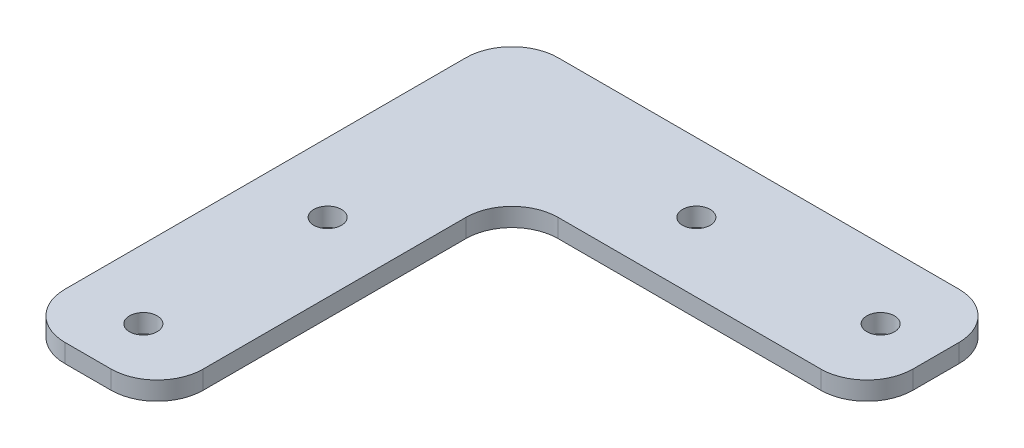
ISO-10303-21;
HEADER;
FILE_DESCRIPTION(('STEP AP214'),'2;1');
FILE_NAME('part.step','',(''),(''),'','','');
FILE_SCHEMA(('AUTOMOTIVE_DESIGN { 1 0 10303 214 1 1 1 1 }'));
ENDSEC;
DATA;
#1=APPLICATION_CONTEXT('core data for automotive mechanical design processes');
#2=APPLICATION_PROTOCOL_DEFINITION('international standard','automotive_design',2000,#1);
#3=PRODUCT_CONTEXT('',#1,'mechanical');
#4=PRODUCT('Part','Part','',(#3));
#5=PRODUCT_RELATED_PRODUCT_CATEGORY('part','',(#4));
#6=PRODUCT_DEFINITION_FORMATION('','',#4);
#7=PRODUCT_DEFINITION_CONTEXT('part definition',#1,'design');
#8=PRODUCT_DEFINITION('design','',#6,#7);
#9=PRODUCT_DEFINITION_SHAPE('','',#8);
#10=(LENGTH_UNIT() NAMED_UNIT(*) SI_UNIT(.MILLI.,.METRE.));
#11=(NAMED_UNIT(*) PLANE_ANGLE_UNIT() SI_UNIT($,.RADIAN.));
#12=(NAMED_UNIT(*) SI_UNIT($,.STERADIAN.) SOLID_ANGLE_UNIT());
#13=UNCERTAINTY_MEASURE_WITH_UNIT(LENGTH_MEASURE(1.E-05),#10,'distance_accuracy_value','');
#14=(GEOMETRIC_REPRESENTATION_CONTEXT(3) GLOBAL_UNCERTAINTY_ASSIGNED_CONTEXT((#13)) GLOBAL_UNIT_ASSIGNED_CONTEXT((#10,
#11,#12)) REPRESENTATION_CONTEXT('',''));
#15=CARTESIAN_POINT('',(0.,0.,0.));
#16=DIRECTION('',(0.,0.,1.));
#17=DIRECTION('',(1.,0.,0.));
#18=AXIS2_PLACEMENT_3D('',#15,#16,#17);
#19=CARTESIAN_POINT('',(0.,2.,0.));
#20=DIRECTION('',(0.,1.,0.));
#21=DIRECTION('',(0.,0.,1.));
#22=AXIS2_PLACEMENT_3D('',#19,#20,#21);
#23=PLANE('',#22);
#24=CARTESIAN_POINT('',(20.,2.,2.15105711021124E-13));
#25=DIRECTION('',(0.,1.,0.));
#26=DIRECTION('',(0.,0.,-1.));
#27=AXIS2_PLACEMENT_3D('',#24,#25,#26);
#28=CIRCLE('',#27,1.5);
#29=CARTESIAN_POINT('',(20.,2.,-1.49999999999979));
#30=VERTEX_POINT('',#29);
#31=EDGE_CURVE('E287',#30,#30,#28,.T.);
#32=ORIENTED_EDGE('',*,*,#31,.F.);
#33=EDGE_LOOP('',(#32));
#34=FACE_BOUND('',#33,.T.);
#35=CARTESIAN_POINT('',(0.,2.,40.));
#36=DIRECTION('',(0.,1.,0.));
#37=DIRECTION('',(0.,0.,1.));
#38=AXIS2_PLACEMENT_3D('',#35,#36,#37);
#39=CIRCLE('',#38,1.5);
#40=CARTESIAN_POINT('',(0.,2.,41.5));
#41=VERTEX_POINT('',#40);
#42=EDGE_CURVE('E273',#41,#41,#39,.T.);
#43=ORIENTED_EDGE('',*,*,#42,.F.);
#44=EDGE_LOOP('',(#43));
#45=FACE_BOUND('',#44,.T.);
#46=DIRECTION('',(1.,0.,0.));
#47=VECTOR('',#46,1.);
#48=CARTESIAN_POINT('',(7.5,2.,46.));
#49=LINE('',#48,#47);
#50=CARTESIAN_POINT('',(-2.5,2.,46.));
#51=VERTEX_POINT('',#50);
#52=CARTESIAN_POINT('',(2.5,2.,46.));
#53=VERTEX_POINT('',#52);
#54=EDGE_CURVE('E250',#51,#53,#49,.T.);
#55=ORIENTED_EDGE('',*,*,#54,.T.);
#56=CARTESIAN_POINT('',(2.5,2.,41.));
#57=DIRECTION('',(0.,1.,0.));
#58=DIRECTION('',(0.,0.,1.));
#59=AXIS2_PLACEMENT_3D('',#56,#57,#58);
#60=CIRCLE('',#59,5.);
#61=CARTESIAN_POINT('',(7.5,2.,41.));
#62=VERTEX_POINT('',#61);
#63=EDGE_CURVE('E209',#53,#62,#60,.T.);
#64=ORIENTED_EDGE('',*,*,#63,.T.);
#65=DIRECTION('',(0.,0.,-1.));
#66=VECTOR('',#65,1.);
#67=CARTESIAN_POINT('',(7.5,2.,7.50000000000007));
#68=LINE('',#67,#66);
#69=CARTESIAN_POINT('',(7.5,2.,12.5000000000001));
#70=VERTEX_POINT('',#69);
#71=EDGE_CURVE('E159',#62,#70,#68,.T.);
#72=ORIENTED_EDGE('',*,*,#71,.T.);
#73=CARTESIAN_POINT('',(12.5,2.,12.5000000000001));
#74=DIRECTION('',(0.,1.,0.));
#75=DIRECTION('',(0.,0.,1.));
#76=AXIS2_PLACEMENT_3D('',#73,#74,#75);
#77=CIRCLE('',#76,5.);
#78=CARTESIAN_POINT('',(12.5000000000001,2.,7.50000000000013));
#79=VERTEX_POINT('',#78);
#80=EDGE_CURVE('E11',#70,#79,#77,.F.);
#81=ORIENTED_EDGE('',*,*,#80,.T.);
#82=DIRECTION('',(1.,0.,0.));
#83=VECTOR('',#82,1.);
#84=CARTESIAN_POINT('',(7.5,2.,7.50000000000007));
#85=LINE('',#84,#83);
#86=CARTESIAN_POINT('',(40.9999999999999,2.,7.50000000000044));
#87=VERTEX_POINT('',#86);
#88=EDGE_CURVE('E168',#79,#87,#85,.T.);
#89=ORIENTED_EDGE('',*,*,#88,.T.);
#90=CARTESIAN_POINT('',(41.,2.,2.50000000000044));
#91=DIRECTION('',(0.,1.,0.));
#92=DIRECTION('',(0.,0.,1.));
#93=AXIS2_PLACEMENT_3D('',#90,#91,#92);
#94=CIRCLE('',#93,5.);
#95=CARTESIAN_POINT('',(46.,2.,2.5000000000005));
#96=VERTEX_POINT('',#95);
#97=EDGE_CURVE('E198',#87,#96,#94,.T.);
#98=ORIENTED_EDGE('',*,*,#97,.T.);
#99=DIRECTION('',(0.,0.,-1.));
#100=VECTOR('',#99,1.);
#101=CARTESIAN_POINT('',(45.9999999999999,2.,7.5000000000005));
#102=LINE('',#101,#100);
#103=CARTESIAN_POINT('',(46.,2.,-2.4999999999995));
#104=VERTEX_POINT('',#103);
#105=EDGE_CURVE('E175',#96,#104,#102,.T.);
#106=ORIENTED_EDGE('',*,*,#105,.T.);
#107=CARTESIAN_POINT('',(41.,2.,-2.49999999999955));
#108=DIRECTION('',(0.,1.,0.));
#109=DIRECTION('',(0.,0.,1.));
#110=AXIS2_PLACEMENT_3D('',#107,#108,#109);
#111=CIRCLE('',#110,5.);
#112=CARTESIAN_POINT('',(41.0000000000001,2.,-7.49999999999955));
#113=VERTEX_POINT('',#112);
#114=EDGE_CURVE('E201',#104,#113,#111,.T.);
#115=ORIENTED_EDGE('',*,*,#114,.T.);
#116=DIRECTION('',(-1.,0.,0.));
#117=VECTOR('',#116,1.);
#118=CARTESIAN_POINT('',(46.0000000000001,2.,-7.4999999999995));
#119=LINE('',#118,#117);
#120=CARTESIAN_POINT('',(-2.49999999999995,2.,-7.50000000000002));
#121=VERTEX_POINT('',#120);
#122=EDGE_CURVE('E260',#113,#121,#119,.T.);
#123=ORIENTED_EDGE('',*,*,#122,.T.);
#124=CARTESIAN_POINT('',(-2.5,2.,-2.50000000000002));
#125=DIRECTION('',(0.,1.,0.));
#126=DIRECTION('',(0.,0.,1.));
#127=AXIS2_PLACEMENT_3D('',#124,#125,#126);
#128=CIRCLE('',#127,5.);
#129=CARTESIAN_POINT('',(-7.5,2.,-2.50000000000002));
#130=VERTEX_POINT('',#129);
#131=EDGE_CURVE('E70',#121,#130,#128,.T.);
#132=ORIENTED_EDGE('',*,*,#131,.T.);
#133=DIRECTION('',(0.,0.,1.));
#134=VECTOR('',#133,1.);
#135=CARTESIAN_POINT('',(-7.5,2.,46.));
#136=LINE('',#135,#134);
#137=CARTESIAN_POINT('',(-7.5,2.,41.));
#138=VERTEX_POINT('',#137);
#139=EDGE_CURVE('E256',#130,#138,#136,.T.);
#140=ORIENTED_EDGE('',*,*,#139,.T.);
#141=CARTESIAN_POINT('',(-2.5,2.,41.));
#142=DIRECTION('',(0.,1.,0.));
#143=DIRECTION('',(0.,0.,1.));
#144=AXIS2_PLACEMENT_3D('',#141,#142,#143);
#145=CIRCLE('',#144,5.);
#146=EDGE_CURVE('E206',#138,#51,#145,.T.);
#147=ORIENTED_EDGE('',*,*,#146,.T.);
#148=EDGE_LOOP('',(#55,#64,#72,#81,#89,#98,#106,#115,#123,#132,#140,#147));
#149=FACE_BOUND('',#148,.T.);
#150=CARTESIAN_POINT('',(0.,2.,20.));
#151=DIRECTION('',(0.,1.,0.));
#152=DIRECTION('',(0.,0.,1.));
#153=AXIS2_PLACEMENT_3D('',#150,#151,#152);
#154=CIRCLE('',#153,1.5);
#155=CARTESIAN_POINT('',(0.,2.,21.5));
#156=VERTEX_POINT('',#155);
#157=EDGE_CURVE('E313',#156,#156,#154,.T.);
#158=ORIENTED_EDGE('',*,*,#157,.F.);
#159=EDGE_LOOP('',(#158));
#160=FACE_BOUND('',#159,.T.);
#161=CARTESIAN_POINT('',(40.,2.,4.37150315946155E-13));
#162=DIRECTION('',(0.,1.,0.));
#163=DIRECTION('',(0.,0.,-1.));
#164=AXIS2_PLACEMENT_3D('',#161,#162,#163);
#165=CIRCLE('',#164,1.5);
#166=CARTESIAN_POINT('',(40.,2.,-1.49999999999957));
#167=VERTEX_POINT('',#166);
#168=EDGE_CURVE('E288',#167,#167,#165,.T.);
#169=ORIENTED_EDGE('',*,*,#168,.F.);
#170=EDGE_LOOP('',(#169));
#171=FACE_BOUND('',#170,.T.);
#172=ADVANCED_FACE('F47',(#34,#45,#149,#160,#171),#23,.T.);
#173=CARTESIAN_POINT('',(0.,0.,0.));
#174=DIRECTION('',(0.,1.,0.));
#175=DIRECTION('',(0.,0.,1.));
#176=AXIS2_PLACEMENT_3D('',#173,#174,#175);
#177=PLANE('',#176);
#178=DIRECTION('',(0.,0.,-1.));
#179=VECTOR('',#178,1.);
#180=CARTESIAN_POINT('',(7.5,0.,7.50000000000007));
#181=LINE('',#180,#179);
#182=CARTESIAN_POINT('',(7.5,0.,41.));
#183=VERTEX_POINT('',#182);
#184=CARTESIAN_POINT('',(7.5,0.,12.5000000000001));
#185=VERTEX_POINT('',#184);
#186=EDGE_CURVE('E156',#183,#185,#181,.T.);
#187=ORIENTED_EDGE('',*,*,#186,.F.);
#188=CARTESIAN_POINT('',(2.5,0.,41.));
#189=DIRECTION('',(0.,1.,0.));
#190=DIRECTION('',(0.,0.,1.));
#191=AXIS2_PLACEMENT_3D('',#188,#189,#190);
#192=CIRCLE('',#191,5.);
#193=CARTESIAN_POINT('',(2.5,0.,46.));
#194=VERTEX_POINT('',#193);
#195=EDGE_CURVE('E138',#183,#194,#192,.F.);
#196=ORIENTED_EDGE('',*,*,#195,.T.);
#197=DIRECTION('',(1.,0.,0.));
#198=VECTOR('',#197,1.);
#199=CARTESIAN_POINT('',(7.5,0.,46.));
#200=LINE('',#199,#198);
#201=CARTESIAN_POINT('',(-2.5,0.,46.));
#202=VERTEX_POINT('',#201);
#203=EDGE_CURVE('E169',#202,#194,#200,.T.);
#204=ORIENTED_EDGE('',*,*,#203,.F.);
#205=CARTESIAN_POINT('',(-2.5,0.,41.));
#206=DIRECTION('',(0.,1.,0.));
#207=DIRECTION('',(0.,0.,1.));
#208=AXIS2_PLACEMENT_3D('',#205,#206,#207);
#209=CIRCLE('',#208,5.);
#210=CARTESIAN_POINT('',(-7.5,0.,41.));
#211=VERTEX_POINT('',#210);
#212=EDGE_CURVE('E150',#202,#211,#209,.F.);
#213=ORIENTED_EDGE('',*,*,#212,.T.);
#214=DIRECTION('',(0.,0.,1.));
#215=VECTOR('',#214,1.);
#216=CARTESIAN_POINT('',(-7.5,0.,46.));
#217=LINE('',#216,#215);
#218=CARTESIAN_POINT('',(-7.5,0.,-2.50000000000002));
#219=VERTEX_POINT('',#218);
#220=EDGE_CURVE('E177',#219,#211,#217,.T.);
#221=ORIENTED_EDGE('',*,*,#220,.F.);
#222=CARTESIAN_POINT('',(-2.5,0.,-2.50000000000002));
#223=DIRECTION('',(0.,1.,0.));
#224=DIRECTION('',(0.,0.,1.));
#225=AXIS2_PLACEMENT_3D('',#222,#223,#224);
#226=CIRCLE('',#225,5.);
#227=CARTESIAN_POINT('',(-2.49999999999995,0.,-7.50000000000002));
#228=VERTEX_POINT('',#227);
#229=EDGE_CURVE('E188',#219,#228,#226,.F.);
#230=ORIENTED_EDGE('',*,*,#229,.T.);
#231=DIRECTION('',(-1.,0.,0.));
#232=VECTOR('',#231,1.);
#233=CARTESIAN_POINT('',(46.0000000000001,0.,-7.4999999999995));
#234=LINE('',#233,#232);
#235=CARTESIAN_POINT('',(41.0000000000001,0.,-7.49999999999955));
#236=VERTEX_POINT('',#235);
#237=EDGE_CURVE('E452',#236,#228,#234,.T.);
#238=ORIENTED_EDGE('',*,*,#237,.F.);
#239=CARTESIAN_POINT('',(41.,0.,-2.49999999999955));
#240=DIRECTION('',(0.,1.,0.));
#241=DIRECTION('',(0.,0.,1.));
#242=AXIS2_PLACEMENT_3D('',#239,#240,#241);
#243=CIRCLE('',#242,5.);
#244=CARTESIAN_POINT('',(46.,0.,-2.4999999999995));
#245=VERTEX_POINT('',#244);
#246=EDGE_CURVE('E185',#236,#245,#243,.F.);
#247=ORIENTED_EDGE('',*,*,#246,.T.);
#248=DIRECTION('',(0.,0.,-1.));
#249=VECTOR('',#248,1.);
#250=CARTESIAN_POINT('',(45.9999999999999,0.,7.5000000000005));
#251=LINE('',#250,#249);
#252=CARTESIAN_POINT('',(46.,0.,2.5000000000005));
#253=VERTEX_POINT('',#252);
#254=EDGE_CURVE('E456',#253,#245,#251,.T.);
#255=ORIENTED_EDGE('',*,*,#254,.F.);
#256=CARTESIAN_POINT('',(41.,0.,2.50000000000044));
#257=DIRECTION('',(0.,1.,0.));
#258=DIRECTION('',(0.,0.,1.));
#259=AXIS2_PLACEMENT_3D('',#256,#257,#258);
#260=CIRCLE('',#259,5.);
#261=CARTESIAN_POINT('',(40.9999999999999,0.,7.50000000000044));
#262=VERTEX_POINT('',#261);
#263=EDGE_CURVE('E161',#253,#262,#260,.F.);
#264=ORIENTED_EDGE('',*,*,#263,.T.);
#265=DIRECTION('',(1.,0.,0.));
#266=VECTOR('',#265,1.);
#267=CARTESIAN_POINT('',(7.5,0.,7.50000000000007));
#268=LINE('',#267,#266);
#269=CARTESIAN_POINT('',(12.5000000000001,0.,7.50000000000013));
#270=VERTEX_POINT('',#269);
#271=EDGE_CURVE('E278',#270,#262,#268,.T.);
#272=ORIENTED_EDGE('',*,*,#271,.F.);
#273=CARTESIAN_POINT('',(12.5,0.,12.5000000000001));
#274=DIRECTION('',(0.,1.,0.));
#275=DIRECTION('',(0.,0.,1.));
#276=AXIS2_PLACEMENT_3D('',#273,#274,#275);
#277=CIRCLE('',#276,5.);
#278=EDGE_CURVE('E56',#270,#185,#277,.T.);
#279=ORIENTED_EDGE('',*,*,#278,.T.);
#280=EDGE_LOOP('',(#187,#196,#204,#213,#221,#230,#238,#247,#255,#264,#272,#279));
#281=FACE_BOUND('',#280,.T.);
#282=CARTESIAN_POINT('',(0.,0.,40.));
#283=DIRECTION('',(0.,1.,0.));
#284=DIRECTION('',(0.,0.,1.));
#285=AXIS2_PLACEMENT_3D('',#282,#283,#284);
#286=CIRCLE('',#285,1.5);
#287=CARTESIAN_POINT('',(0.,0.,41.5));
#288=VERTEX_POINT('',#287);
#289=EDGE_CURVE('E279',#288,#288,#286,.T.);
#290=ORIENTED_EDGE('',*,*,#289,.T.);
#291=EDGE_LOOP('',(#290));
#292=FACE_BOUND('',#291,.T.);
#293=CARTESIAN_POINT('',(0.,0.,20.));
#294=DIRECTION('',(0.,1.,0.));
#295=DIRECTION('',(0.,0.,1.));
#296=AXIS2_PLACEMENT_3D('',#293,#294,#295);
#297=CIRCLE('',#296,1.5);
#298=CARTESIAN_POINT('',(0.,0.,21.5));
#299=VERTEX_POINT('',#298);
#300=EDGE_CURVE('E307',#299,#299,#297,.T.);
#301=ORIENTED_EDGE('',*,*,#300,.T.);
#302=EDGE_LOOP('',(#301));
#303=FACE_BOUND('',#302,.T.);
#304=CARTESIAN_POINT('',(20.,0.,2.15105711021124E-13));
#305=DIRECTION('',(0.,1.,0.));
#306=DIRECTION('',(0.,0.,-1.));
#307=AXIS2_PLACEMENT_3D('',#304,#305,#306);
#308=CIRCLE('',#307,1.5);
#309=CARTESIAN_POINT('',(20.,0.,-1.49999999999979));
#310=VERTEX_POINT('',#309);
#311=EDGE_CURVE('E283',#310,#310,#308,.T.);
#312=ORIENTED_EDGE('',*,*,#311,.T.);
#313=EDGE_LOOP('',(#312));
#314=FACE_BOUND('',#313,.T.);
#315=CARTESIAN_POINT('',(40.,0.,4.37150315946155E-13));
#316=DIRECTION('',(0.,1.,0.));
#317=DIRECTION('',(0.,0.,-1.));
#318=AXIS2_PLACEMENT_3D('',#315,#316,#317);
#319=CIRCLE('',#318,1.5);
#320=CARTESIAN_POINT('',(40.,0.,-1.49999999999957));
#321=VERTEX_POINT('',#320);
#322=EDGE_CURVE('E293',#321,#321,#319,.T.);
#323=ORIENTED_EDGE('',*,*,#322,.T.);
#324=EDGE_LOOP('',(#323));
#325=FACE_BOUND('',#324,.T.);
#326=ADVANCED_FACE('F164',(#281,#292,#303,#314,#325),#177,.F.);
#327=CARTESIAN_POINT('',(7.5,2.,7.50000000000007));
#328=DIRECTION('',(0.,0.,-1.));
#329=DIRECTION('',(-1.,0.,0.));
#330=AXIS2_PLACEMENT_3D('',#327,#328,#329);
#331=PLANE('',#330);
#332=ORIENTED_EDGE('',*,*,#271,.T.);
#333=DIRECTION('',(0.,-1.,0.));
#334=VECTOR('',#333,1.);
#335=CARTESIAN_POINT('',(40.9999999999999,2.,7.50000000000044));
#336=LINE('',#335,#334);
#337=EDGE_CURVE('E236',#262,#87,#336,.F.);
#338=ORIENTED_EDGE('',*,*,#337,.T.);
#339=ORIENTED_EDGE('',*,*,#88,.F.);
#340=DIRECTION('',(0.,-1.,0.));
#341=VECTOR('',#340,1.);
#342=CARTESIAN_POINT('',(12.5000000000001,0.,7.50000000000013));
#343=LINE('',#342,#341);
#344=EDGE_CURVE('E232',#79,#270,#343,.T.);
#345=ORIENTED_EDGE('',*,*,#344,.T.);
#346=EDGE_LOOP('',(#332,#338,#339,#345));
#347=FACE_BOUND('',#346,.T.);
#348=ADVANCED_FACE('F374',(#347),#331,.F.);
#349=CARTESIAN_POINT('',(45.9999999999999,2.,7.5000000000005));
#350=DIRECTION('',(-1.,0.,0.));
#351=DIRECTION('',(0.,0.,1.));
#352=AXIS2_PLACEMENT_3D('',#349,#350,#351);
#353=PLANE('',#352);
#354=ORIENTED_EDGE('',*,*,#254,.T.);
#355=DIRECTION('',(0.,-1.,0.));
#356=VECTOR('',#355,1.);
#357=CARTESIAN_POINT('',(46.,2.,-2.4999999999995));
#358=LINE('',#357,#356);
#359=EDGE_CURVE('E229',#245,#104,#358,.F.);
#360=ORIENTED_EDGE('',*,*,#359,.T.);
#361=ORIENTED_EDGE('',*,*,#105,.F.);
#362=DIRECTION('',(0.,-1.,0.));
#363=VECTOR('',#362,1.);
#364=CARTESIAN_POINT('',(46.,2.,2.5000000000005));
#365=LINE('',#364,#363);
#366=EDGE_CURVE('E225',#96,#253,#365,.T.);
#367=ORIENTED_EDGE('',*,*,#366,.T.);
#368=EDGE_LOOP('',(#354,#360,#361,#367));
#369=FACE_BOUND('',#368,.T.);
#370=ADVANCED_FACE('F378',(#369),#353,.F.);
#371=CARTESIAN_POINT('',(46.0000000000001,2.,-7.4999999999995));
#372=DIRECTION('',(0.,0.,1.));
#373=DIRECTION('',(1.,0.,0.));
#374=AXIS2_PLACEMENT_3D('',#371,#372,#373);
#375=PLANE('',#374);
#376=ORIENTED_EDGE('',*,*,#237,.T.);
#377=DIRECTION('',(0.,-1.,0.));
#378=VECTOR('',#377,1.);
#379=CARTESIAN_POINT('',(-2.49999999999995,2.,-7.50000000000002));
#380=LINE('',#379,#378);
#381=EDGE_CURVE('E222',#228,#121,#380,.F.);
#382=ORIENTED_EDGE('',*,*,#381,.T.);
#383=ORIENTED_EDGE('',*,*,#122,.F.);
#384=DIRECTION('',(0.,-1.,0.));
#385=VECTOR('',#384,1.);
#386=CARTESIAN_POINT('',(41.0000000000001,2.,-7.49999999999955));
#387=LINE('',#386,#385);
#388=EDGE_CURVE('E218',#113,#236,#387,.T.);
#389=ORIENTED_EDGE('',*,*,#388,.T.);
#390=EDGE_LOOP('',(#376,#382,#383,#389));
#391=FACE_BOUND('',#390,.T.);
#392=ADVANCED_FACE('F330',(#391),#375,.F.);
#393=CARTESIAN_POINT('',(-7.5,2.,46.));
#394=DIRECTION('',(1.,0.,0.));
#395=DIRECTION('',(0.,0.,-1.));
#396=AXIS2_PLACEMENT_3D('',#393,#394,#395);
#397=PLANE('',#396);
#398=ORIENTED_EDGE('',*,*,#220,.T.);
#399=DIRECTION('',(0.,-1.,0.));
#400=VECTOR('',#399,1.);
#401=CARTESIAN_POINT('',(-7.5,2.,41.));
#402=LINE('',#401,#400);
#403=EDGE_CURVE('E63',#211,#138,#402,.F.);
#404=ORIENTED_EDGE('',*,*,#403,.T.);
#405=ORIENTED_EDGE('',*,*,#139,.F.);
#406=DIRECTION('',(0.,-1.,0.));
#407=VECTOR('',#406,1.);
#408=CARTESIAN_POINT('',(-7.5,2.,-2.50000000000002));
#409=LINE('',#408,#407);
#410=EDGE_CURVE('E212',#130,#219,#409,.T.);
#411=ORIENTED_EDGE('',*,*,#410,.T.);
#412=EDGE_LOOP('',(#398,#404,#405,#411));
#413=FACE_BOUND('',#412,.T.);
#414=ADVANCED_FACE('F325',(#413),#397,.F.);
#415=CARTESIAN_POINT('',(7.5,2.,46.));
#416=DIRECTION('',(0.,0.,-1.));
#417=DIRECTION('',(-1.,0.,0.));
#418=AXIS2_PLACEMENT_3D('',#415,#416,#417);
#419=PLANE('',#418);
#420=ORIENTED_EDGE('',*,*,#203,.T.);
#421=DIRECTION('',(0.,-1.,0.));
#422=VECTOR('',#421,1.);
#423=CARTESIAN_POINT('',(2.5,2.,46.));
#424=LINE('',#423,#422);
#425=EDGE_CURVE('E143',#194,#53,#424,.F.);
#426=ORIENTED_EDGE('',*,*,#425,.T.);
#427=ORIENTED_EDGE('',*,*,#54,.F.);
#428=DIRECTION('',(0.,-1.,0.));
#429=VECTOR('',#428,1.);
#430=CARTESIAN_POINT('',(-2.5,2.,46.));
#431=LINE('',#430,#429);
#432=EDGE_CURVE('E149',#51,#202,#431,.T.);
#433=ORIENTED_EDGE('',*,*,#432,.T.);
#434=EDGE_LOOP('',(#420,#426,#427,#433));
#435=FACE_BOUND('',#434,.T.);
#436=ADVANCED_FACE('F329',(#435),#419,.F.);
#437=CARTESIAN_POINT('',(7.5,2.,7.50000000000007));
#438=DIRECTION('',(-1.,0.,0.));
#439=DIRECTION('',(0.,0.,1.));
#440=AXIS2_PLACEMENT_3D('',#437,#438,#439);
#441=PLANE('',#440);
#442=ORIENTED_EDGE('',*,*,#71,.F.);
#443=DIRECTION('',(0.,-1.,0.));
#444=VECTOR('',#443,1.);
#445=CARTESIAN_POINT('',(7.5,2.,41.));
#446=LINE('',#445,#444);
#447=EDGE_CURVE('E142',#62,#183,#446,.T.);
#448=ORIENTED_EDGE('',*,*,#447,.T.);
#449=ORIENTED_EDGE('',*,*,#186,.T.);
#450=DIRECTION('',(0.,-1.,0.));
#451=VECTOR('',#450,1.);
#452=CARTESIAN_POINT('',(7.5,2.,12.5000000000001));
#453=LINE('',#452,#451);
#454=EDGE_CURVE('E162',#185,#70,#453,.F.);
#455=ORIENTED_EDGE('',*,*,#454,.T.);
#456=EDGE_LOOP('',(#442,#448,#449,#455));
#457=FACE_BOUND('',#456,.T.);
#458=ADVANCED_FACE('F155',(#457),#441,.F.);
#459=CARTESIAN_POINT('',(0.,2.,40.));
#460=DIRECTION('',(0.,-1.,0.));
#461=DIRECTION('',(0.,0.,-1.));
#462=AXIS2_PLACEMENT_3D('',#459,#460,#461);
#463=CYLINDRICAL_SURFACE('',#462,1.5);
#464=ORIENTED_EDGE('',*,*,#42,.T.);
#465=EDGE_LOOP('',(#464));
#466=FACE_BOUND('',#465,.T.);
#467=ORIENTED_EDGE('',*,*,#289,.F.);
#468=EDGE_LOOP('',(#467));
#469=FACE_BOUND('',#468,.T.);
#470=ADVANCED_FACE('F362',(#466,#469),#463,.F.);
#471=CARTESIAN_POINT('',(0.,2.,20.));
#472=DIRECTION('',(0.,-1.,0.));
#473=DIRECTION('',(0.,0.,-1.));
#474=AXIS2_PLACEMENT_3D('',#471,#472,#473);
#475=CYLINDRICAL_SURFACE('',#474,1.5);
#476=ORIENTED_EDGE('',*,*,#157,.T.);
#477=EDGE_LOOP('',(#476));
#478=FACE_BOUND('',#477,.T.);
#479=ORIENTED_EDGE('',*,*,#300,.F.);
#480=EDGE_LOOP('',(#479));
#481=FACE_BOUND('',#480,.T.);
#482=ADVANCED_FACE('F423',(#478,#481),#475,.F.);
#483=CARTESIAN_POINT('',(20.,2.,2.15105711021124E-13));
#484=DIRECTION('',(0.,-1.,0.));
#485=DIRECTION('',(0.,0.,-1.));
#486=AXIS2_PLACEMENT_3D('',#483,#484,#485);
#487=CYLINDRICAL_SURFACE('',#486,1.5);
#488=ORIENTED_EDGE('',*,*,#31,.T.);
#489=EDGE_LOOP('',(#488));
#490=FACE_BOUND('',#489,.T.);
#491=ORIENTED_EDGE('',*,*,#311,.F.);
#492=EDGE_LOOP('',(#491));
#493=FACE_BOUND('',#492,.T.);
#494=ADVANCED_FACE('F419',(#490,#493),#487,.F.);
#495=CARTESIAN_POINT('',(40.,2.,4.37150315946155E-13));
#496=DIRECTION('',(0.,-1.,0.));
#497=DIRECTION('',(0.,0.,-1.));
#498=AXIS2_PLACEMENT_3D('',#495,#496,#497);
#499=CYLINDRICAL_SURFACE('',#498,1.5);
#500=ORIENTED_EDGE('',*,*,#168,.T.);
#501=EDGE_LOOP('',(#500));
#502=FACE_BOUND('',#501,.T.);
#503=ORIENTED_EDGE('',*,*,#322,.F.);
#504=EDGE_LOOP('',(#503));
#505=FACE_BOUND('',#504,.T.);
#506=ADVANCED_FACE('F356',(#502,#505),#499,.F.);
#507=CARTESIAN_POINT('',(2.5,2.,41.));
#508=DIRECTION('',(0.,-1.,0.));
#509=DIRECTION('',(0.,0.,-1.));
#510=AXIS2_PLACEMENT_3D('',#507,#508,#509);
#511=CYLINDRICAL_SURFACE('',#510,5.);
#512=ORIENTED_EDGE('',*,*,#63,.F.);
#513=ORIENTED_EDGE('',*,*,#425,.F.);
#514=ORIENTED_EDGE('',*,*,#195,.F.);
#515=ORIENTED_EDGE('',*,*,#447,.F.);
#516=EDGE_LOOP('',(#512,#513,#514,#515));
#517=FACE_BOUND('',#516,.T.);
#518=ADVANCED_FACE('F141',(#517),#511,.T.);
#519=CARTESIAN_POINT('',(-2.5,2.,41.));
#520=DIRECTION('',(0.,-1.,0.));
#521=DIRECTION('',(0.,0.,-1.));
#522=AXIS2_PLACEMENT_3D('',#519,#520,#521);
#523=CYLINDRICAL_SURFACE('',#522,5.);
#524=ORIENTED_EDGE('',*,*,#146,.F.);
#525=ORIENTED_EDGE('',*,*,#403,.F.);
#526=ORIENTED_EDGE('',*,*,#212,.F.);
#527=ORIENTED_EDGE('',*,*,#432,.F.);
#528=EDGE_LOOP('',(#524,#525,#526,#527));
#529=FACE_BOUND('',#528,.T.);
#530=ADVANCED_FACE('F336',(#529),#523,.T.);
#531=CARTESIAN_POINT('',(-2.5,2.,-2.50000000000002));
#532=DIRECTION('',(0.,-1.,0.));
#533=DIRECTION('',(0.,0.,-1.));
#534=AXIS2_PLACEMENT_3D('',#531,#532,#533);
#535=CYLINDRICAL_SURFACE('',#534,5.);
#536=ORIENTED_EDGE('',*,*,#131,.F.);
#537=ORIENTED_EDGE('',*,*,#381,.F.);
#538=ORIENTED_EDGE('',*,*,#229,.F.);
#539=ORIENTED_EDGE('',*,*,#410,.F.);
#540=EDGE_LOOP('',(#536,#537,#538,#539));
#541=FACE_BOUND('',#540,.T.);
#542=ADVANCED_FACE('F340',(#541),#535,.T.);
#543=CARTESIAN_POINT('',(41.,2.,-2.49999999999955));
#544=DIRECTION('',(0.,-1.,0.));
#545=DIRECTION('',(0.,0.,-1.));
#546=AXIS2_PLACEMENT_3D('',#543,#544,#545);
#547=CYLINDRICAL_SURFACE('',#546,5.);
#548=ORIENTED_EDGE('',*,*,#114,.F.);
#549=ORIENTED_EDGE('',*,*,#359,.F.);
#550=ORIENTED_EDGE('',*,*,#246,.F.);
#551=ORIENTED_EDGE('',*,*,#388,.F.);
#552=EDGE_LOOP('',(#548,#549,#550,#551));
#553=FACE_BOUND('',#552,.T.);
#554=ADVANCED_FACE('F385',(#553),#547,.T.);
#555=CARTESIAN_POINT('',(41.,2.,2.50000000000044));
#556=DIRECTION('',(0.,-1.,0.));
#557=DIRECTION('',(0.,0.,-1.));
#558=AXIS2_PLACEMENT_3D('',#555,#556,#557);
#559=CYLINDRICAL_SURFACE('',#558,5.);
#560=ORIENTED_EDGE('',*,*,#97,.F.);
#561=ORIENTED_EDGE('',*,*,#337,.F.);
#562=ORIENTED_EDGE('',*,*,#263,.F.);
#563=ORIENTED_EDGE('',*,*,#366,.F.);
#564=EDGE_LOOP('',(#560,#561,#562,#563));
#565=FACE_BOUND('',#564,.T.);
#566=ADVANCED_FACE('F369',(#565),#559,.T.);
#567=CARTESIAN_POINT('',(12.5,2.,12.5000000000001));
#568=DIRECTION('',(0.,1.,0.));
#569=DIRECTION('',(0.,0.,1.));
#570=AXIS2_PLACEMENT_3D('',#567,#568,#569);
#571=CYLINDRICAL_SURFACE('',#570,5.);
#572=ORIENTED_EDGE('',*,*,#80,.F.);
#573=ORIENTED_EDGE('',*,*,#454,.F.);
#574=ORIENTED_EDGE('',*,*,#278,.F.);
#575=ORIENTED_EDGE('',*,*,#344,.F.);
#576=EDGE_LOOP('',(#572,#573,#574,#575));
#577=FACE_BOUND('',#576,.T.);
#578=ADVANCED_FACE('F49',(#577),#571,.F.);
#579=CLOSED_SHELL('',(#172,#326,#348,#370,#392,#414,#436,#458,#470,#482,#494,#506,#518,#530,
#542,#554,#566,#578));
#580=MANIFOLD_SOLID_BREP('B2',#579);
#581=ADVANCED_BREP_SHAPE_REPRESENTATION('',(#18,#580),#14);
#582=SHAPE_DEFINITION_REPRESENTATION(#9,#581);
ENDSEC;
END-ISO-10303-21;
